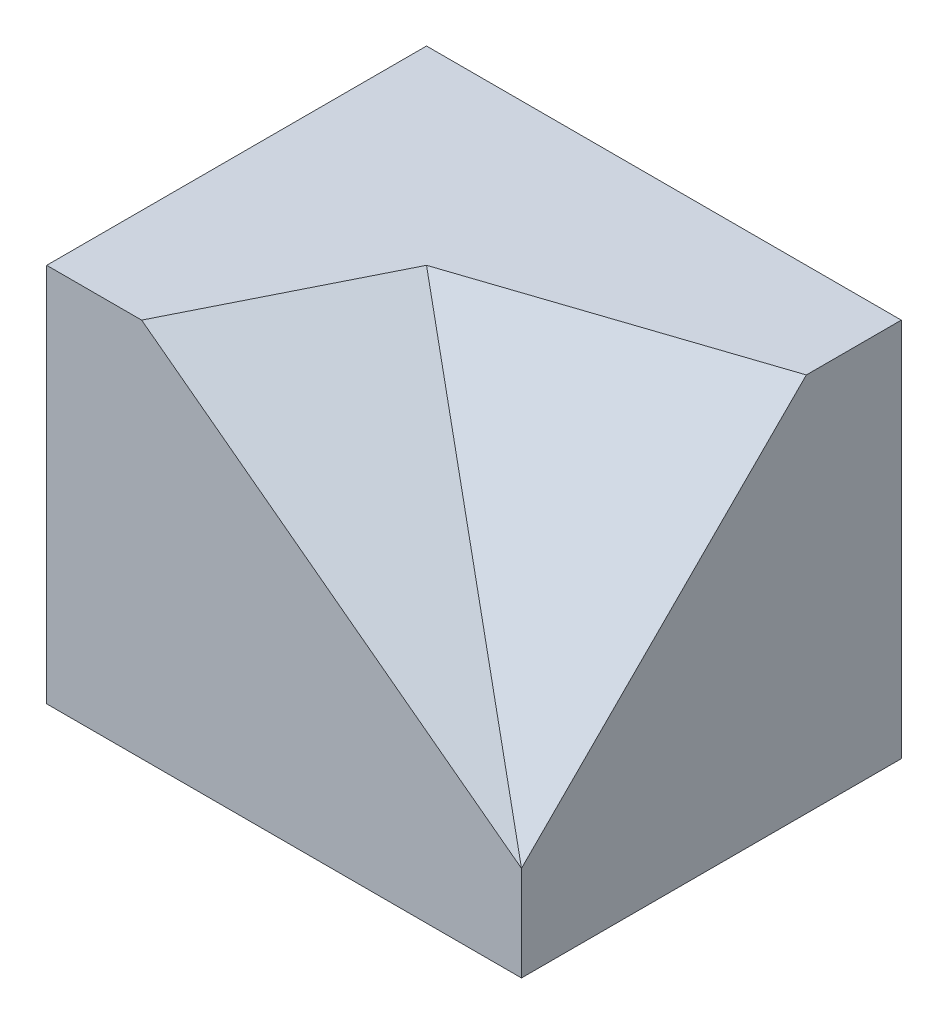
ISO-10303-21;
HEADER;
FILE_DESCRIPTION(('STEP AP214'),'2;1');
FILE_NAME('part.step','',(''),(''),'','','');
FILE_SCHEMA(('AUTOMOTIVE_DESIGN { 1 0 10303 214 1 1 1 1 }'));
ENDSEC;
DATA;
#1=APPLICATION_CONTEXT('core data for automotive mechanical design processes');
#2=APPLICATION_PROTOCOL_DEFINITION('international standard','automotive_design',2000,#1);
#3=PRODUCT_CONTEXT('',#1,'mechanical');
#4=PRODUCT('Part','Part','',(#3));
#5=PRODUCT_RELATED_PRODUCT_CATEGORY('part','',(#4));
#6=PRODUCT_DEFINITION_FORMATION('','',#4);
#7=PRODUCT_DEFINITION_CONTEXT('part definition',#1,'design');
#8=PRODUCT_DEFINITION('design','',#6,#7);
#9=PRODUCT_DEFINITION_SHAPE('','',#8);
#10=(LENGTH_UNIT() NAMED_UNIT(*) SI_UNIT(.MILLI.,.METRE.));
#11=(NAMED_UNIT(*) PLANE_ANGLE_UNIT() SI_UNIT($,.RADIAN.));
#12=(NAMED_UNIT(*) SI_UNIT($,.STERADIAN.) SOLID_ANGLE_UNIT());
#13=UNCERTAINTY_MEASURE_WITH_UNIT(LENGTH_MEASURE(1.E-05),#10,'distance_accuracy_value','');
#14=(GEOMETRIC_REPRESENTATION_CONTEXT(3) GLOBAL_UNCERTAINTY_ASSIGNED_CONTEXT((#13)) GLOBAL_UNIT_ASSIGNED_CONTEXT((#10,
#11,#12)) REPRESENTATION_CONTEXT('',''));
#15=CARTESIAN_POINT('',(0.,0.,0.));
#16=DIRECTION('',(0.,0.,1.));
#17=DIRECTION('',(1.,0.,0.));
#18=AXIS2_PLACEMENT_3D('',#15,#16,#17);
#19=CARTESIAN_POINT('',(1.89160839160839,11.4055944055944,-2.52447552447553));
#20=DIRECTION('',(-1.,0.,0.));
#21=DIRECTION('',(0.,0.,1.));
#22=AXIS2_PLACEMENT_3D('',#19,#20,#21);
#23=PLANE('',#22);
#24=DIRECTION('',(0.,0.707106781186547,-0.707106781186548));
#25=VECTOR('',#24,1.);
#26=CARTESIAN_POINT('',(1.89160839160839,8.40559440559441,1.47552447552447));
#27=LINE('',#26,#25);
#28=CARTESIAN_POINT('',(1.89160839160839,8.40559440559441,1.47552447552447));
#29=VERTEX_POINT('',#28);
#30=CARTESIAN_POINT('',(1.89160839160839,11.4055944055944,-1.52447552447553));
#31=VERTEX_POINT('',#30);
#32=EDGE_CURVE('E96',#29,#31,#27,.T.);
#33=ORIENTED_EDGE('',*,*,#32,.F.);
#34=DIRECTION('',(0.,-1.,0.));
#35=VECTOR('',#34,1.);
#36=CARTESIAN_POINT('',(1.89160839160839,11.4055944055944,1.47552447552447));
#37=LINE('',#36,#35);
#38=CARTESIAN_POINT('',(1.89160839160839,7.4055944055944,1.47552447552447));
#39=VERTEX_POINT('',#38);
#40=EDGE_CURVE('E44',#29,#39,#37,.T.);
#41=ORIENTED_EDGE('',*,*,#40,.T.);
#42=DIRECTION('',(0.,0.,-1.));
#43=VECTOR('',#42,1.);
#44=CARTESIAN_POINT('',(1.89160839160839,7.4055944055944,-2.52447552447553));
#45=LINE('',#44,#43);
#46=CARTESIAN_POINT('',(1.89160839160839,7.4055944055944,-2.52447552447553));
#47=VERTEX_POINT('',#46);
#48=EDGE_CURVE('E123',#39,#47,#45,.T.);
#49=ORIENTED_EDGE('',*,*,#48,.T.);
#50=DIRECTION('',(0.,-1.,0.));
#51=VECTOR('',#50,1.);
#52=CARTESIAN_POINT('',(1.89160839160839,11.4055944055944,-2.52447552447553));
#53=LINE('',#52,#51);
#54=CARTESIAN_POINT('',(1.89160839160839,11.4055944055944,-2.52447552447553));
#55=VERTEX_POINT('',#54);
#56=EDGE_CURVE('E116',#55,#47,#53,.T.);
#57=ORIENTED_EDGE('',*,*,#56,.F.);
#58=DIRECTION('',(0.,0.,-1.));
#59=VECTOR('',#58,1.);
#60=CARTESIAN_POINT('',(1.89160839160839,11.4055944055944,-2.52447552447553));
#61=LINE('',#60,#59);
#62=EDGE_CURVE('E108',#31,#55,#61,.T.);
#63=ORIENTED_EDGE('',*,*,#62,.F.);
#64=EDGE_LOOP('',(#33,#41,#49,#57,#63));
#65=FACE_BOUND('',#64,.T.);
#66=ADVANCED_FACE('F36',(#65),#23,.F.);
#67=CARTESIAN_POINT('',(-0.608391608391607,11.4055944055944,-0.524475524475526));
#68=DIRECTION('',(0.,-1.,0.));
#69=DIRECTION('',(0.,0.,-1.));
#70=AXIS2_PLACEMENT_3D('',#67,#68,#69);
#71=PLANE('',#70);
#72=DIRECTION('',(-0.948683298050514,0.,0.316227766016838));
#73=VECTOR('',#72,1.);
#74=CARTESIAN_POINT('',(-1.10839160839161,11.4055944055944,-0.524475524475526));
#75=LINE('',#74,#73);
#76=CARTESIAN_POINT('',(-1.10839160839161,11.4055944055944,-0.524475524475527));
#77=VERTEX_POINT('',#76);
#78=EDGE_CURVE('E51',#31,#77,#75,.T.);
#79=ORIENTED_EDGE('',*,*,#78,.F.);
#80=ORIENTED_EDGE('',*,*,#62,.T.);
#81=DIRECTION('',(-1.,0.,0.));
#82=VECTOR('',#81,1.);
#83=CARTESIAN_POINT('',(1.89160839160839,11.4055944055944,-2.52447552447553));
#84=LINE('',#83,#82);
#85=CARTESIAN_POINT('',(-3.10839160839161,11.4055944055944,-2.52447552447553));
#86=VERTEX_POINT('',#85);
#87=EDGE_CURVE('E60',#55,#86,#84,.T.);
#88=ORIENTED_EDGE('',*,*,#87,.T.);
#89=DIRECTION('',(0.,0.,1.));
#90=VECTOR('',#89,1.);
#91=CARTESIAN_POINT('',(-3.10839160839161,11.4055944055944,-2.52447552447553));
#92=LINE('',#91,#90);
#93=CARTESIAN_POINT('',(-3.10839160839161,11.4055944055944,1.47552447552447));
#94=VERTEX_POINT('',#93);
#95=EDGE_CURVE('E122',#86,#94,#92,.T.);
#96=ORIENTED_EDGE('',*,*,#95,.T.);
#97=DIRECTION('',(1.,0.,0.));
#98=VECTOR('',#97,1.);
#99=CARTESIAN_POINT('',(1.89160839160839,11.4055944055944,1.47552447552447));
#100=LINE('',#99,#98);
#101=CARTESIAN_POINT('',(-2.10839160839161,11.4055944055944,1.47552447552447));
#102=VERTEX_POINT('',#101);
#103=EDGE_CURVE('E86',#94,#102,#100,.T.);
#104=ORIENTED_EDGE('',*,*,#103,.T.);
#105=DIRECTION('',(-0.447213595499958,0.,0.894427190999916));
#106=VECTOR('',#105,1.);
#107=CARTESIAN_POINT('',(-1.00839160839161,11.4055944055944,-0.724475524475527));
#108=LINE('',#107,#106);
#109=EDGE_CURVE('E101',#77,#102,#108,.T.);
#110=ORIENTED_EDGE('',*,*,#109,.F.);
#111=EDGE_LOOP('',(#79,#80,#88,#96,#104,#110));
#112=FACE_BOUND('',#111,.T.);
#113=ADVANCED_FACE('F135',(#112),#71,.F.);
#114=CARTESIAN_POINT('',(-3.10839160839161,11.4055944055944,-2.52447552447553));
#115=DIRECTION('',(1.,0.,0.));
#116=DIRECTION('',(0.,0.,-1.));
#117=AXIS2_PLACEMENT_3D('',#114,#115,#116);
#118=PLANE('',#117);
#119=DIRECTION('',(0.,0.,1.));
#120=VECTOR('',#119,1.);
#121=CARTESIAN_POINT('',(-3.10839160839161,7.4055944055944,-2.52447552447553));
#122=LINE('',#121,#120);
#123=CARTESIAN_POINT('',(-3.10839160839161,7.4055944055944,-2.52447552447553));
#124=VERTEX_POINT('',#123);
#125=CARTESIAN_POINT('',(-3.10839160839161,7.4055944055944,1.47552447552447));
#126=VERTEX_POINT('',#125);
#127=EDGE_CURVE('E111',#124,#126,#122,.T.);
#128=ORIENTED_EDGE('',*,*,#127,.T.);
#129=DIRECTION('',(0.,-1.,0.));
#130=VECTOR('',#129,1.);
#131=CARTESIAN_POINT('',(-3.10839160839161,11.4055944055944,1.47552447552447));
#132=LINE('',#131,#130);
#133=EDGE_CURVE('E11',#94,#126,#132,.T.);
#134=ORIENTED_EDGE('',*,*,#133,.F.);
#135=ORIENTED_EDGE('',*,*,#95,.F.);
#136=DIRECTION('',(0.,-1.,0.));
#137=VECTOR('',#136,1.);
#138=CARTESIAN_POINT('',(-3.10839160839161,11.4055944055944,-2.52447552447553));
#139=LINE('',#138,#137);
#140=EDGE_CURVE('E117',#86,#124,#139,.T.);
#141=ORIENTED_EDGE('',*,*,#140,.T.);
#142=EDGE_LOOP('',(#128,#134,#135,#141));
#143=FACE_BOUND('',#142,.T.);
#144=ADVANCED_FACE('F38',(#143),#118,.F.);
#145=CARTESIAN_POINT('',(1.89160839160839,11.4055944055944,1.47552447552447));
#146=DIRECTION('',(0.,0.,-1.));
#147=DIRECTION('',(-1.,0.,0.));
#148=AXIS2_PLACEMENT_3D('',#145,#146,#147);
#149=PLANE('',#148);
#150=ORIENTED_EDGE('',*,*,#40,.F.);
#151=DIRECTION('',(0.8,-0.6,0.));
#152=VECTOR('',#151,1.);
#153=CARTESIAN_POINT('',(0.771608391608393,9.2455944055944,1.47552447552447));
#154=LINE('',#153,#152);
#155=EDGE_CURVE('E100',#102,#29,#154,.T.);
#156=ORIENTED_EDGE('',*,*,#155,.F.);
#157=ORIENTED_EDGE('',*,*,#103,.F.);
#158=ORIENTED_EDGE('',*,*,#133,.T.);
#159=DIRECTION('',(1.,0.,0.));
#160=VECTOR('',#159,1.);
#161=CARTESIAN_POINT('',(1.89160839160839,7.4055944055944,1.47552447552447));
#162=LINE('',#161,#160);
#163=EDGE_CURVE('E114',#126,#39,#162,.T.);
#164=ORIENTED_EDGE('',*,*,#163,.T.);
#165=EDGE_LOOP('',(#150,#156,#157,#158,#164));
#166=FACE_BOUND('',#165,.T.);
#167=ADVANCED_FACE('F113',(#166),#149,.F.);
#168=CARTESIAN_POINT('',(1.89160839160839,11.4055944055944,-2.52447552447553));
#169=DIRECTION('',(0.,0.,1.));
#170=DIRECTION('',(1.,0.,0.));
#171=AXIS2_PLACEMENT_3D('',#168,#169,#170);
#172=PLANE('',#171);
#173=DIRECTION('',(-1.,0.,0.));
#174=VECTOR('',#173,1.);
#175=CARTESIAN_POINT('',(1.89160839160839,7.4055944055944,-2.52447552447553));
#176=LINE('',#175,#174);
#177=EDGE_CURVE('E80',#47,#124,#176,.T.);
#178=ORIENTED_EDGE('',*,*,#177,.T.);
#179=ORIENTED_EDGE('',*,*,#140,.F.);
#180=ORIENTED_EDGE('',*,*,#87,.F.);
#181=ORIENTED_EDGE('',*,*,#56,.T.);
#182=EDGE_LOOP('',(#178,#179,#180,#181));
#183=FACE_BOUND('',#182,.T.);
#184=ADVANCED_FACE('F140',(#183),#172,.F.);
#185=CARTESIAN_POINT('',(-0.608391608391607,7.4055944055944,-0.524475524475526));
#186=DIRECTION('',(0.,-1.,0.));
#187=DIRECTION('',(0.,0.,-1.));
#188=AXIS2_PLACEMENT_3D('',#185,#186,#187);
#189=PLANE('',#188);
#190=ORIENTED_EDGE('',*,*,#127,.F.);
#191=ORIENTED_EDGE('',*,*,#177,.F.);
#192=ORIENTED_EDGE('',*,*,#48,.F.);
#193=ORIENTED_EDGE('',*,*,#163,.F.);
#194=EDGE_LOOP('',(#190,#191,#192,#193));
#195=FACE_BOUND('',#194,.T.);
#196=ADVANCED_FACE('F139',(#195),#189,.T.);
#197=CARTESIAN_POINT('',(0.98793866683775,9.53403477256688,0.273689613139153));
#198=DIRECTION('',(-0.574695771132691,-0.766261028176921,-0.287347885566345));
#199=DIRECTION('',(0.8,-0.6,0.));
#200=AXIS2_PLACEMENT_3D('',#197,#198,#199);
#201=PLANE('',#200);
#202=ORIENTED_EDGE('',*,*,#109,.T.);
#203=ORIENTED_EDGE('',*,*,#155,.T.);
#204=DIRECTION('',(0.639602149066832,-0.639602149066831,0.426401432711221));
#205=VECTOR('',#204,1.);
#206=CARTESIAN_POINT('',(0.732517482517484,9.56468531468531,0.7027972027972));
#207=LINE('',#206,#205);
#208=EDGE_CURVE('E93',#77,#29,#207,.T.);
#209=ORIENTED_EDGE('',*,*,#208,.F.);
#210=EDGE_LOOP('',(#202,#203,#209));
#211=FACE_BOUND('',#210,.T.);
#212=ADVANCED_FACE('F110',(#211),#201,.F.);
#213=CARTESIAN_POINT('',(-0.00312845049686913,9.22138387927862,1.29131394920868));
#214=DIRECTION('',(0.229415733870562,0.688247201611685,0.688247201611685));
#215=DIRECTION('',(0.,-0.707106781186547,0.707106781186548));
#216=AXIS2_PLACEMENT_3D('',#213,#214,#215);
#217=PLANE('',#216);
#218=ORIENTED_EDGE('',*,*,#208,.T.);
#219=ORIENTED_EDGE('',*,*,#32,.T.);
#220=ORIENTED_EDGE('',*,*,#78,.T.);
#221=EDGE_LOOP('',(#218,#219,#220));
#222=FACE_BOUND('',#221,.T.);
#223=ADVANCED_FACE('F95',(#222),#217,.T.);
#224=CLOSED_SHELL('',(#66,#113,#144,#167,#184,#196,#212,#223));
#225=MANIFOLD_SOLID_BREP('B2',#224);
#226=ADVANCED_BREP_SHAPE_REPRESENTATION('',(#18,#225),#14);
#227=SHAPE_DEFINITION_REPRESENTATION(#9,#226);
ENDSEC;
END-ISO-10303-21;
